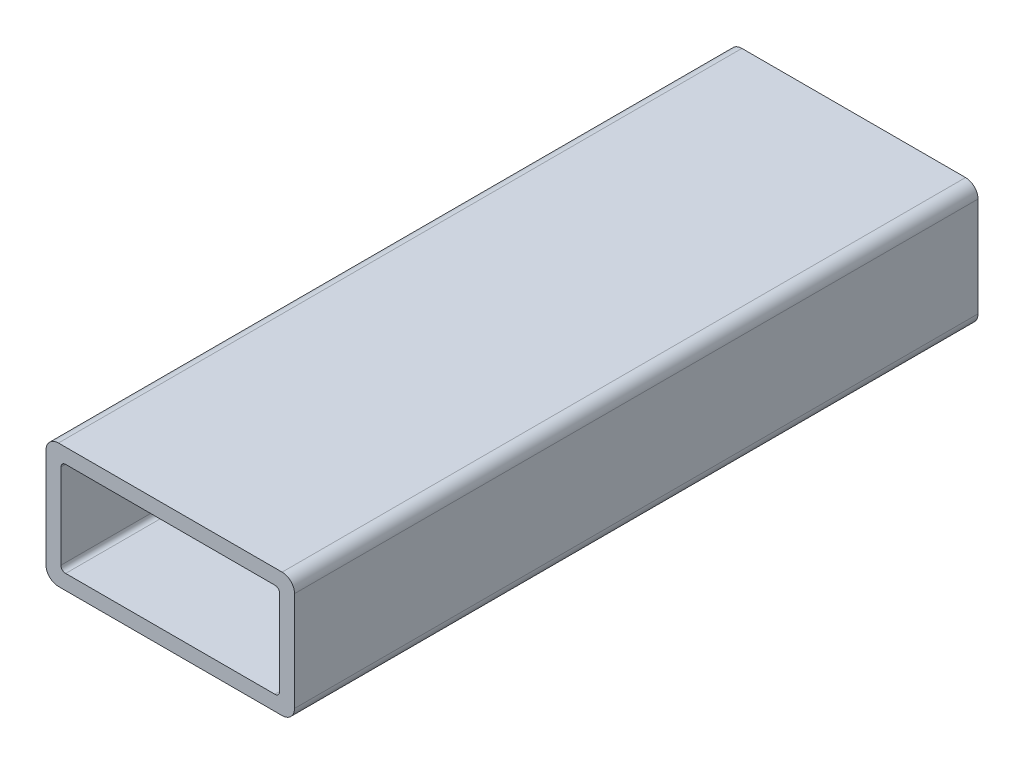
ISO-10303-21;
HEADER;
FILE_DESCRIPTION(('STEP AP214'),'2;1');
FILE_NAME('part.step','',(''),(''),'','','');
FILE_SCHEMA(('AUTOMOTIVE_DESIGN { 1 0 10303 214 1 1 1 1 }'));
ENDSEC;
DATA;
#1=APPLICATION_CONTEXT('core data for automotive mechanical design processes');
#2=APPLICATION_PROTOCOL_DEFINITION('international standard','automotive_design',2000,#1);
#3=PRODUCT_CONTEXT('',#1,'mechanical');
#4=PRODUCT('Part','Part','',(#3));
#5=PRODUCT_RELATED_PRODUCT_CATEGORY('part','',(#4));
#6=PRODUCT_DEFINITION_FORMATION('','',#4);
#7=PRODUCT_DEFINITION_CONTEXT('part definition',#1,'design');
#8=PRODUCT_DEFINITION('design','',#6,#7);
#9=PRODUCT_DEFINITION_SHAPE('','',#8);
#10=(LENGTH_UNIT() NAMED_UNIT(*) SI_UNIT(.MILLI.,.METRE.));
#11=(NAMED_UNIT(*) PLANE_ANGLE_UNIT() SI_UNIT($,.RADIAN.));
#12=(NAMED_UNIT(*) SI_UNIT($,.STERADIAN.) SOLID_ANGLE_UNIT());
#13=UNCERTAINTY_MEASURE_WITH_UNIT(LENGTH_MEASURE(1.E-05),#10,'distance_accuracy_value','');
#14=(GEOMETRIC_REPRESENTATION_CONTEXT(3) GLOBAL_UNCERTAINTY_ASSIGNED_CONTEXT((#13)) GLOBAL_UNIT_ASSIGNED_CONTEXT((#10,
#11,#12)) REPRESENTATION_CONTEXT('',''));
#15=CARTESIAN_POINT('',(0.,0.,0.));
#16=DIRECTION('',(0.,0.,1.));
#17=DIRECTION('',(1.,0.,0.));
#18=AXIS2_PLACEMENT_3D('',#15,#16,#17);
#19=CARTESIAN_POINT('',(22.86,-10.16,139.7));
#20=DIRECTION('',(0.,0.,1.));
#21=DIRECTION('',(1.,0.,0.));
#22=AXIS2_PLACEMENT_3D('',#19,#20,#21);
#23=PLANE('',#22);
#24=CARTESIAN_POINT('',(22.86,-10.16,139.7));
#25=DIRECTION('',(0.,0.,1.));
#26=DIRECTION('',(1.,0.,0.));
#27=AXIS2_PLACEMENT_3D('',#24,#25,#26);
#28=CIRCLE('',#27,2.54);
#29=CARTESIAN_POINT('',(22.86,-12.7,139.7));
#30=VERTEX_POINT('',#29);
#31=CARTESIAN_POINT('',(25.4,-10.16,139.7));
#32=VERTEX_POINT('',#31);
#33=EDGE_CURVE('E244',#30,#32,#28,.T.);
#34=ORIENTED_EDGE('',*,*,#33,.T.);
#35=DIRECTION('',(0.,1.,0.));
#36=VECTOR('',#35,1.);
#37=CARTESIAN_POINT('',(25.4,-10.16,139.7));
#38=LINE('',#37,#36);
#39=CARTESIAN_POINT('',(25.4,10.16,139.7));
#40=VERTEX_POINT('',#39);
#41=EDGE_CURVE('E248',#32,#40,#38,.T.);
#42=ORIENTED_EDGE('',*,*,#41,.T.);
#43=CARTESIAN_POINT('',(22.86,10.16,139.7));
#44=DIRECTION('',(0.,0.,1.));
#45=DIRECTION('',(1.,0.,0.));
#46=AXIS2_PLACEMENT_3D('',#43,#44,#45);
#47=CIRCLE('',#46,2.54);
#48=CARTESIAN_POINT('',(22.86,12.7,139.7));
#49=VERTEX_POINT('',#48);
#50=EDGE_CURVE('E252',#40,#49,#47,.T.);
#51=ORIENTED_EDGE('',*,*,#50,.T.);
#52=DIRECTION('',(-1.,0.,0.));
#53=VECTOR('',#52,1.);
#54=CARTESIAN_POINT('',(22.86,12.7,139.7));
#55=LINE('',#54,#53);
#56=CARTESIAN_POINT('',(-22.86,12.7,139.7));
#57=VERTEX_POINT('',#56);
#58=EDGE_CURVE('E255',#49,#57,#55,.T.);
#59=ORIENTED_EDGE('',*,*,#58,.T.);
#60=CARTESIAN_POINT('',(-22.86,10.16,139.7));
#61=DIRECTION('',(0.,0.,1.));
#62=DIRECTION('',(1.,0.,0.));
#63=AXIS2_PLACEMENT_3D('',#60,#61,#62);
#64=CIRCLE('',#63,2.54);
#65=CARTESIAN_POINT('',(-25.4,10.16,139.7));
#66=VERTEX_POINT('',#65);
#67=EDGE_CURVE('E258',#57,#66,#64,.T.);
#68=ORIENTED_EDGE('',*,*,#67,.T.);
#69=DIRECTION('',(0.,-1.,0.));
#70=VECTOR('',#69,1.);
#71=CARTESIAN_POINT('',(-25.4,-10.16,139.7));
#72=LINE('',#71,#70);
#73=CARTESIAN_POINT('',(-25.4,-10.16,139.7));
#74=VERTEX_POINT('',#73);
#75=EDGE_CURVE('E261',#66,#74,#72,.T.);
#76=ORIENTED_EDGE('',*,*,#75,.T.);
#77=CARTESIAN_POINT('',(-22.86,-10.16,139.7));
#78=DIRECTION('',(0.,0.,1.));
#79=DIRECTION('',(1.,0.,0.));
#80=AXIS2_PLACEMENT_3D('',#77,#78,#79);
#81=CIRCLE('',#80,2.54);
#82=CARTESIAN_POINT('',(-22.86,-12.7,139.7));
#83=VERTEX_POINT('',#82);
#84=EDGE_CURVE('E264',#74,#83,#81,.T.);
#85=ORIENTED_EDGE('',*,*,#84,.T.);
#86=DIRECTION('',(1.,0.,0.));
#87=VECTOR('',#86,1.);
#88=CARTESIAN_POINT('',(22.86,-12.7,139.7));
#89=LINE('',#88,#87);
#90=EDGE_CURVE('E267',#83,#30,#89,.T.);
#91=ORIENTED_EDGE('',*,*,#90,.T.);
#92=EDGE_LOOP('',(#34,#42,#51,#59,#68,#76,#85,#91));
#93=FACE_BOUND('',#92,.T.);
#94=DIRECTION('',(-1.,0.,0.));
#95=VECTOR('',#94,1.);
#96=CARTESIAN_POINT('',(21.3868,9.65199999999999,139.7));
#97=LINE('',#96,#95);
#98=CARTESIAN_POINT('',(21.3868,9.65199999999999,139.7));
#99=VERTEX_POINT('',#98);
#100=CARTESIAN_POINT('',(-21.3868,9.652,139.7));
#101=VERTEX_POINT('',#100);
#102=EDGE_CURVE('E164',#99,#101,#97,.T.);
#103=ORIENTED_EDGE('',*,*,#102,.F.);
#104=CARTESIAN_POINT('',(21.3868,8.6868,139.7));
#105=DIRECTION('',(0.,0.,1.));
#106=DIRECTION('',(1.,0.,0.));
#107=AXIS2_PLACEMENT_3D('',#104,#105,#106);
#108=CIRCLE('',#107,0.965199999999993);
#109=CARTESIAN_POINT('',(22.352,8.68680000000001,139.7));
#110=VERTEX_POINT('',#109);
#111=EDGE_CURVE('E155',#110,#99,#108,.T.);
#112=ORIENTED_EDGE('',*,*,#111,.F.);
#113=DIRECTION('',(0.,1.,0.));
#114=VECTOR('',#113,1.);
#115=CARTESIAN_POINT('',(22.352,8.68680000000001,139.7));
#116=LINE('',#115,#114);
#117=CARTESIAN_POINT('',(22.352,-8.6868,139.7));
#118=VERTEX_POINT('',#117);
#119=EDGE_CURVE('E196',#118,#110,#116,.T.);
#120=ORIENTED_EDGE('',*,*,#119,.F.);
#121=CARTESIAN_POINT('',(21.3868,-8.6868,139.7));
#122=DIRECTION('',(0.,0.,1.));
#123=DIRECTION('',(1.,0.,0.));
#124=AXIS2_PLACEMENT_3D('',#121,#122,#123);
#125=CIRCLE('',#124,0.965199999999999);
#126=CARTESIAN_POINT('',(21.3868,-9.652,139.7));
#127=VERTEX_POINT('',#126);
#128=EDGE_CURVE('E193',#127,#118,#125,.T.);
#129=ORIENTED_EDGE('',*,*,#128,.F.);
#130=DIRECTION('',(1.,0.,0.));
#131=VECTOR('',#130,1.);
#132=CARTESIAN_POINT('',(21.3868,-9.652,139.7));
#133=LINE('',#132,#131);
#134=CARTESIAN_POINT('',(-21.3868,-9.652,139.7));
#135=VERTEX_POINT('',#134);
#136=EDGE_CURVE('E190',#135,#127,#133,.T.);
#137=ORIENTED_EDGE('',*,*,#136,.F.);
#138=CARTESIAN_POINT('',(-21.3868,-8.6868,139.7));
#139=DIRECTION('',(0.,0.,1.));
#140=DIRECTION('',(1.,0.,0.));
#141=AXIS2_PLACEMENT_3D('',#138,#139,#140);
#142=CIRCLE('',#141,0.965199999999999);
#143=CARTESIAN_POINT('',(-22.352,-8.6868,139.7));
#144=VERTEX_POINT('',#143);
#145=EDGE_CURVE('E187',#144,#135,#142,.T.);
#146=ORIENTED_EDGE('',*,*,#145,.F.);
#147=DIRECTION('',(0.,-1.,0.));
#148=VECTOR('',#147,1.);
#149=CARTESIAN_POINT('',(-22.352,8.6868,139.7));
#150=LINE('',#149,#148);
#151=CARTESIAN_POINT('',(-22.352,8.6868,139.7));
#152=VERTEX_POINT('',#151);
#153=EDGE_CURVE('E182',#152,#144,#150,.T.);
#154=ORIENTED_EDGE('',*,*,#153,.F.);
#155=CARTESIAN_POINT('',(-21.3868,8.6868,139.7));
#156=DIRECTION('',(0.,0.,1.));
#157=DIRECTION('',(1.,0.,0.));
#158=AXIS2_PLACEMENT_3D('',#155,#156,#157);
#159=CIRCLE('',#158,0.965199999999999);
#160=EDGE_CURVE('E178',#101,#152,#159,.T.);
#161=ORIENTED_EDGE('',*,*,#160,.F.);
#162=EDGE_LOOP('',(#103,#112,#120,#129,#137,#146,#154,#161));
#163=FACE_BOUND('',#162,.T.);
#164=ADVANCED_FACE('F41',(#93,#163),#23,.T.);
#165=CARTESIAN_POINT('',(22.86,-10.16,0.));
#166=DIRECTION('',(0.,0.,1.));
#167=DIRECTION('',(1.,0.,0.));
#168=AXIS2_PLACEMENT_3D('',#165,#166,#167);
#169=PLANE('',#168);
#170=CARTESIAN_POINT('',(22.86,-10.16,0.));
#171=DIRECTION('',(0.,0.,1.));
#172=DIRECTION('',(1.,0.,0.));
#173=AXIS2_PLACEMENT_3D('',#170,#171,#172);
#174=CIRCLE('',#173,2.54);
#175=CARTESIAN_POINT('',(22.86,-12.7,0.));
#176=VERTEX_POINT('',#175);
#177=CARTESIAN_POINT('',(25.4,-10.16,0.));
#178=VERTEX_POINT('',#177);
#179=EDGE_CURVE('E173',#176,#178,#174,.T.);
#180=ORIENTED_EDGE('',*,*,#179,.F.);
#181=DIRECTION('',(1.,0.,0.));
#182=VECTOR('',#181,1.);
#183=CARTESIAN_POINT('',(22.86,-12.7,0.));
#184=LINE('',#183,#182);
#185=CARTESIAN_POINT('',(-22.86,-12.7,0.));
#186=VERTEX_POINT('',#185);
#187=EDGE_CURVE('E249',#186,#176,#184,.T.);
#188=ORIENTED_EDGE('',*,*,#187,.F.);
#189=CARTESIAN_POINT('',(-22.86,-10.16,0.));
#190=DIRECTION('',(0.,0.,1.));
#191=DIRECTION('',(1.,0.,0.));
#192=AXIS2_PLACEMENT_3D('',#189,#190,#191);
#193=CIRCLE('',#192,2.54);
#194=CARTESIAN_POINT('',(-25.4,-10.16,0.));
#195=VERTEX_POINT('',#194);
#196=EDGE_CURVE('E289',#195,#186,#193,.T.);
#197=ORIENTED_EDGE('',*,*,#196,.F.);
#198=DIRECTION('',(0.,-1.,0.));
#199=VECTOR('',#198,1.);
#200=CARTESIAN_POINT('',(-25.4,-10.16,0.));
#201=LINE('',#200,#199);
#202=CARTESIAN_POINT('',(-25.4,10.16,0.));
#203=VERTEX_POINT('',#202);
#204=EDGE_CURVE('E286',#203,#195,#201,.T.);
#205=ORIENTED_EDGE('',*,*,#204,.F.);
#206=CARTESIAN_POINT('',(-22.86,10.16,0.));
#207=DIRECTION('',(0.,0.,1.));
#208=DIRECTION('',(1.,0.,0.));
#209=AXIS2_PLACEMENT_3D('',#206,#207,#208);
#210=CIRCLE('',#209,2.54);
#211=CARTESIAN_POINT('',(-22.86,12.7,0.));
#212=VERTEX_POINT('',#211);
#213=EDGE_CURVE('E283',#212,#203,#210,.T.);
#214=ORIENTED_EDGE('',*,*,#213,.F.);
#215=DIRECTION('',(-1.,0.,0.));
#216=VECTOR('',#215,1.);
#217=CARTESIAN_POINT('',(22.86,12.7,0.));
#218=LINE('',#217,#216);
#219=CARTESIAN_POINT('',(22.86,12.7,0.));
#220=VERTEX_POINT('',#219);
#221=EDGE_CURVE('E280',#220,#212,#218,.T.);
#222=ORIENTED_EDGE('',*,*,#221,.F.);
#223=CARTESIAN_POINT('',(22.86,10.16,0.));
#224=DIRECTION('',(0.,0.,1.));
#225=DIRECTION('',(1.,0.,0.));
#226=AXIS2_PLACEMENT_3D('',#223,#224,#225);
#227=CIRCLE('',#226,2.54);
#228=CARTESIAN_POINT('',(25.4,10.16,0.));
#229=VERTEX_POINT('',#228);
#230=EDGE_CURVE('E277',#229,#220,#227,.T.);
#231=ORIENTED_EDGE('',*,*,#230,.F.);
#232=DIRECTION('',(0.,1.,0.));
#233=VECTOR('',#232,1.);
#234=CARTESIAN_POINT('',(25.4,-10.16,0.));
#235=LINE('',#234,#233);
#236=EDGE_CURVE('E274',#178,#229,#235,.T.);
#237=ORIENTED_EDGE('',*,*,#236,.F.);
#238=EDGE_LOOP('',(#180,#188,#197,#205,#214,#222,#231,#237));
#239=FACE_BOUND('',#238,.T.);
#240=CARTESIAN_POINT('',(21.3868,8.6868,0.));
#241=DIRECTION('',(0.,0.,1.));
#242=DIRECTION('',(1.,0.,0.));
#243=AXIS2_PLACEMENT_3D('',#240,#241,#242);
#244=CIRCLE('',#243,0.965199999999993);
#245=CARTESIAN_POINT('',(22.352,8.68680000000001,0.));
#246=VERTEX_POINT('',#245);
#247=CARTESIAN_POINT('',(21.3868,9.65199999999999,0.));
#248=VERTEX_POINT('',#247);
#249=EDGE_CURVE('E65',#246,#248,#244,.T.);
#250=ORIENTED_EDGE('',*,*,#249,.T.);
#251=DIRECTION('',(-1.,0.,0.));
#252=VECTOR('',#251,1.);
#253=CARTESIAN_POINT('',(21.3868,9.65199999999999,0.));
#254=LINE('',#253,#252);
#255=CARTESIAN_POINT('',(-21.3868,9.652,0.));
#256=VERTEX_POINT('',#255);
#257=EDGE_CURVE('E171',#248,#256,#254,.T.);
#258=ORIENTED_EDGE('',*,*,#257,.T.);
#259=CARTESIAN_POINT('',(-21.3868,8.6868,0.));
#260=DIRECTION('',(0.,0.,1.));
#261=DIRECTION('',(1.,0.,0.));
#262=AXIS2_PLACEMENT_3D('',#259,#260,#261);
#263=CIRCLE('',#262,0.965199999999999);
#264=CARTESIAN_POINT('',(-22.352,8.6868,0.));
#265=VERTEX_POINT('',#264);
#266=EDGE_CURVE('E203',#256,#265,#263,.T.);
#267=ORIENTED_EDGE('',*,*,#266,.T.);
#268=DIRECTION('',(0.,-1.,0.));
#269=VECTOR('',#268,1.);
#270=CARTESIAN_POINT('',(-22.352,8.6868,0.));
#271=LINE('',#270,#269);
#272=CARTESIAN_POINT('',(-22.352,-8.6868,0.));
#273=VERTEX_POINT('',#272);
#274=EDGE_CURVE('E207',#265,#273,#271,.T.);
#275=ORIENTED_EDGE('',*,*,#274,.T.);
#276=CARTESIAN_POINT('',(-21.3868,-8.6868,0.));
#277=DIRECTION('',(0.,0.,1.));
#278=DIRECTION('',(1.,0.,0.));
#279=AXIS2_PLACEMENT_3D('',#276,#277,#278);
#280=CIRCLE('',#279,0.965199999999999);
#281=CARTESIAN_POINT('',(-21.3868,-9.652,0.));
#282=VERTEX_POINT('',#281);
#283=EDGE_CURVE('E211',#273,#282,#280,.T.);
#284=ORIENTED_EDGE('',*,*,#283,.T.);
#285=DIRECTION('',(1.,0.,0.));
#286=VECTOR('',#285,1.);
#287=CARTESIAN_POINT('',(21.3868,-9.652,0.));
#288=LINE('',#287,#286);
#289=CARTESIAN_POINT('',(21.3868,-9.652,0.));
#290=VERTEX_POINT('',#289);
#291=EDGE_CURVE('E215',#282,#290,#288,.T.);
#292=ORIENTED_EDGE('',*,*,#291,.T.);
#293=CARTESIAN_POINT('',(21.3868,-8.6868,0.));
#294=DIRECTION('',(0.,0.,1.));
#295=DIRECTION('',(1.,0.,0.));
#296=AXIS2_PLACEMENT_3D('',#293,#294,#295);
#297=CIRCLE('',#296,0.965199999999999);
#298=CARTESIAN_POINT('',(22.352,-8.6868,0.));
#299=VERTEX_POINT('',#298);
#300=EDGE_CURVE('E219',#290,#299,#297,.T.);
#301=ORIENTED_EDGE('',*,*,#300,.T.);
#302=DIRECTION('',(0.,1.,0.));
#303=VECTOR('',#302,1.);
#304=CARTESIAN_POINT('',(22.352,8.68680000000001,0.));
#305=LINE('',#304,#303);
#306=EDGE_CURVE('E165',#299,#246,#305,.T.);
#307=ORIENTED_EDGE('',*,*,#306,.T.);
#308=EDGE_LOOP('',(#250,#258,#267,#275,#284,#292,#301,#307));
#309=FACE_BOUND('',#308,.T.);
#310=ADVANCED_FACE('F328',(#239,#309),#169,.F.);
#311=CARTESIAN_POINT('',(22.86,-10.16,139.7));
#312=DIRECTION('',(0.,0.,-1.));
#313=DIRECTION('',(-1.,0.,0.));
#314=AXIS2_PLACEMENT_3D('',#311,#312,#313);
#315=CYLINDRICAL_SURFACE('',#314,2.54);
#316=ORIENTED_EDGE('',*,*,#179,.T.);
#317=DIRECTION('',(0.,0.,-1.));
#318=VECTOR('',#317,1.);
#319=CARTESIAN_POINT('',(25.4,-10.16,139.7));
#320=LINE('',#319,#318);
#321=EDGE_CURVE('E11',#32,#178,#320,.T.);
#322=ORIENTED_EDGE('',*,*,#321,.F.);
#323=ORIENTED_EDGE('',*,*,#33,.F.);
#324=DIRECTION('',(0.,0.,-1.));
#325=VECTOR('',#324,1.);
#326=CARTESIAN_POINT('',(22.86,-12.7,139.7));
#327=LINE('',#326,#325);
#328=EDGE_CURVE('E270',#30,#176,#327,.T.);
#329=ORIENTED_EDGE('',*,*,#328,.T.);
#330=EDGE_LOOP('',(#316,#322,#323,#329));
#331=FACE_BOUND('',#330,.T.);
#332=ADVANCED_FACE('F43',(#331),#315,.T.);
#333=CARTESIAN_POINT('',(25.4,-10.16,139.7));
#334=DIRECTION('',(-1.,0.,0.));
#335=DIRECTION('',(0.,0.,1.));
#336=AXIS2_PLACEMENT_3D('',#333,#334,#335);
#337=PLANE('',#336);
#338=ORIENTED_EDGE('',*,*,#236,.T.);
#339=DIRECTION('',(0.,0.,-1.));
#340=VECTOR('',#339,1.);
#341=CARTESIAN_POINT('',(25.4,10.16,139.7));
#342=LINE('',#341,#340);
#343=EDGE_CURVE('E50',#40,#229,#342,.T.);
#344=ORIENTED_EDGE('',*,*,#343,.F.);
#345=ORIENTED_EDGE('',*,*,#41,.F.);
#346=ORIENTED_EDGE('',*,*,#321,.T.);
#347=EDGE_LOOP('',(#338,#344,#345,#346));
#348=FACE_BOUND('',#347,.T.);
#349=ADVANCED_FACE('F345',(#348),#337,.F.);
#350=CARTESIAN_POINT('',(22.86,10.16,139.7));
#351=DIRECTION('',(0.,0.,-1.));
#352=DIRECTION('',(-1.,0.,0.));
#353=AXIS2_PLACEMENT_3D('',#350,#351,#352);
#354=CYLINDRICAL_SURFACE('',#353,2.54);
#355=ORIENTED_EDGE('',*,*,#230,.T.);
#356=DIRECTION('',(0.,0.,-1.));
#357=VECTOR('',#356,1.);
#358=CARTESIAN_POINT('',(22.86,12.7,139.7));
#359=LINE('',#358,#357);
#360=EDGE_CURVE('E313',#49,#220,#359,.T.);
#361=ORIENTED_EDGE('',*,*,#360,.F.);
#362=ORIENTED_EDGE('',*,*,#50,.F.);
#363=ORIENTED_EDGE('',*,*,#343,.T.);
#364=EDGE_LOOP('',(#355,#361,#362,#363));
#365=FACE_BOUND('',#364,.T.);
#366=ADVANCED_FACE('F322',(#365),#354,.T.);
#367=CARTESIAN_POINT('',(22.86,12.7,139.7));
#368=DIRECTION('',(0.,-1.,0.));
#369=DIRECTION('',(0.,0.,-1.));
#370=AXIS2_PLACEMENT_3D('',#367,#368,#369);
#371=PLANE('',#370);
#372=ORIENTED_EDGE('',*,*,#221,.T.);
#373=DIRECTION('',(0.,0.,-1.));
#374=VECTOR('',#373,1.);
#375=CARTESIAN_POINT('',(-22.86,12.7,139.7));
#376=LINE('',#375,#374);
#377=EDGE_CURVE('E309',#57,#212,#376,.T.);
#378=ORIENTED_EDGE('',*,*,#377,.F.);
#379=ORIENTED_EDGE('',*,*,#58,.F.);
#380=ORIENTED_EDGE('',*,*,#360,.T.);
#381=EDGE_LOOP('',(#372,#378,#379,#380));
#382=FACE_BOUND('',#381,.T.);
#383=ADVANCED_FACE('F334',(#382),#371,.F.);
#384=CARTESIAN_POINT('',(-22.86,10.16,139.7));
#385=DIRECTION('',(0.,0.,-1.));
#386=DIRECTION('',(-1.,0.,0.));
#387=AXIS2_PLACEMENT_3D('',#384,#385,#386);
#388=CYLINDRICAL_SURFACE('',#387,2.54);
#389=ORIENTED_EDGE('',*,*,#213,.T.);
#390=DIRECTION('',(0.,0.,-1.));
#391=VECTOR('',#390,1.);
#392=CARTESIAN_POINT('',(-25.4,10.16,139.7));
#393=LINE('',#392,#391);
#394=EDGE_CURVE('E305',#66,#203,#393,.T.);
#395=ORIENTED_EDGE('',*,*,#394,.F.);
#396=ORIENTED_EDGE('',*,*,#67,.F.);
#397=ORIENTED_EDGE('',*,*,#377,.T.);
#398=EDGE_LOOP('',(#389,#395,#396,#397));
#399=FACE_BOUND('',#398,.T.);
#400=ADVANCED_FACE('F338',(#399),#388,.T.);
#401=CARTESIAN_POINT('',(-25.4,-10.16,139.7));
#402=DIRECTION('',(1.,0.,0.));
#403=DIRECTION('',(0.,0.,-1.));
#404=AXIS2_PLACEMENT_3D('',#401,#402,#403);
#405=PLANE('',#404);
#406=ORIENTED_EDGE('',*,*,#204,.T.);
#407=DIRECTION('',(0.,0.,-1.));
#408=VECTOR('',#407,1.);
#409=CARTESIAN_POINT('',(-25.4,-10.16,139.7));
#410=LINE('',#409,#408);
#411=EDGE_CURVE('E301',#74,#195,#410,.T.);
#412=ORIENTED_EDGE('',*,*,#411,.F.);
#413=ORIENTED_EDGE('',*,*,#75,.F.);
#414=ORIENTED_EDGE('',*,*,#394,.T.);
#415=EDGE_LOOP('',(#406,#412,#413,#414));
#416=FACE_BOUND('',#415,.T.);
#417=ADVANCED_FACE('F358',(#416),#405,.F.);
#418=CARTESIAN_POINT('',(-22.86,-10.16,139.7));
#419=DIRECTION('',(0.,0.,-1.));
#420=DIRECTION('',(-1.,0.,0.));
#421=AXIS2_PLACEMENT_3D('',#418,#419,#420);
#422=CYLINDRICAL_SURFACE('',#421,2.54);
#423=ORIENTED_EDGE('',*,*,#196,.T.);
#424=DIRECTION('',(0.,0.,-1.));
#425=VECTOR('',#424,1.);
#426=CARTESIAN_POINT('',(-22.86,-12.7,139.7));
#427=LINE('',#426,#425);
#428=EDGE_CURVE('E297',#83,#186,#427,.T.);
#429=ORIENTED_EDGE('',*,*,#428,.F.);
#430=ORIENTED_EDGE('',*,*,#84,.F.);
#431=ORIENTED_EDGE('',*,*,#411,.T.);
#432=EDGE_LOOP('',(#423,#429,#430,#431));
#433=FACE_BOUND('',#432,.T.);
#434=ADVANCED_FACE('F356',(#433),#422,.T.);
#435=CARTESIAN_POINT('',(22.86,-12.7,139.7));
#436=DIRECTION('',(0.,1.,0.));
#437=DIRECTION('',(0.,0.,1.));
#438=AXIS2_PLACEMENT_3D('',#435,#436,#437);
#439=PLANE('',#438);
#440=ORIENTED_EDGE('',*,*,#187,.T.);
#441=ORIENTED_EDGE('',*,*,#328,.F.);
#442=ORIENTED_EDGE('',*,*,#90,.F.);
#443=ORIENTED_EDGE('',*,*,#428,.T.);
#444=EDGE_LOOP('',(#440,#441,#442,#443));
#445=FACE_BOUND('',#444,.T.);
#446=ADVANCED_FACE('F351',(#445),#439,.F.);
#447=CARTESIAN_POINT('',(21.3868,8.6868,139.7));
#448=DIRECTION('',(0.,0.,-1.));
#449=DIRECTION('',(-1.,0.,0.));
#450=AXIS2_PLACEMENT_3D('',#447,#448,#449);
#451=CYLINDRICAL_SURFACE('',#450,0.965199999999993);
#452=ORIENTED_EDGE('',*,*,#249,.F.);
#453=DIRECTION('',(0.,0.,-1.));
#454=VECTOR('',#453,1.);
#455=CARTESIAN_POINT('',(22.352,8.68680000000001,139.7));
#456=LINE('',#455,#454);
#457=EDGE_CURVE('E159',#110,#246,#456,.T.);
#458=ORIENTED_EDGE('',*,*,#457,.F.);
#459=ORIENTED_EDGE('',*,*,#111,.T.);
#460=DIRECTION('',(0.,0.,-1.));
#461=VECTOR('',#460,1.);
#462=CARTESIAN_POINT('',(21.3868,9.65199999999999,139.7));
#463=LINE('',#462,#461);
#464=EDGE_CURVE('E158',#99,#248,#463,.T.);
#465=ORIENTED_EDGE('',*,*,#464,.T.);
#466=EDGE_LOOP('',(#452,#458,#459,#465));
#467=FACE_BOUND('',#466,.T.);
#468=ADVANCED_FACE('F157',(#467),#451,.F.);
#469=CARTESIAN_POINT('',(21.3868,9.65199999999999,139.7));
#470=DIRECTION('',(0.,-1.,0.));
#471=DIRECTION('',(1.,0.,0.));
#472=AXIS2_PLACEMENT_3D('',#469,#470,#471);
#473=PLANE('',#472);
#474=ORIENTED_EDGE('',*,*,#257,.F.);
#475=ORIENTED_EDGE('',*,*,#464,.F.);
#476=ORIENTED_EDGE('',*,*,#102,.T.);
#477=DIRECTION('',(0.,0.,-1.));
#478=VECTOR('',#477,1.);
#479=CARTESIAN_POINT('',(-21.3868,9.652,139.7));
#480=LINE('',#479,#478);
#481=EDGE_CURVE('E174',#101,#256,#480,.T.);
#482=ORIENTED_EDGE('',*,*,#481,.T.);
#483=EDGE_LOOP('',(#474,#475,#476,#482));
#484=FACE_BOUND('',#483,.T.);
#485=ADVANCED_FACE('F168',(#484),#473,.T.);
#486=CARTESIAN_POINT('',(-21.3868,8.6868,139.7));
#487=DIRECTION('',(0.,0.,-1.));
#488=DIRECTION('',(-1.,0.,0.));
#489=AXIS2_PLACEMENT_3D('',#486,#487,#488);
#490=CYLINDRICAL_SURFACE('',#489,0.965199999999999);
#491=ORIENTED_EDGE('',*,*,#266,.F.);
#492=ORIENTED_EDGE('',*,*,#481,.F.);
#493=ORIENTED_EDGE('',*,*,#160,.T.);
#494=DIRECTION('',(0.,0.,-1.));
#495=VECTOR('',#494,1.);
#496=CARTESIAN_POINT('',(-22.352,8.6868,139.7));
#497=LINE('',#496,#495);
#498=EDGE_CURVE('E239',#152,#265,#497,.T.);
#499=ORIENTED_EDGE('',*,*,#498,.T.);
#500=EDGE_LOOP('',(#491,#492,#493,#499));
#501=FACE_BOUND('',#500,.T.);
#502=ADVANCED_FACE('F383',(#501),#490,.F.);
#503=CARTESIAN_POINT('',(-22.352,8.6868,139.7));
#504=DIRECTION('',(1.,0.,0.));
#505=DIRECTION('',(0.,0.,-1.));
#506=AXIS2_PLACEMENT_3D('',#503,#504,#505);
#507=PLANE('',#506);
#508=ORIENTED_EDGE('',*,*,#274,.F.);
#509=ORIENTED_EDGE('',*,*,#498,.F.);
#510=ORIENTED_EDGE('',*,*,#153,.T.);
#511=DIRECTION('',(0.,0.,-1.));
#512=VECTOR('',#511,1.);
#513=CARTESIAN_POINT('',(-22.352,-8.6868,139.7));
#514=LINE('',#513,#512);
#515=EDGE_CURVE('E236',#144,#273,#514,.T.);
#516=ORIENTED_EDGE('',*,*,#515,.T.);
#517=EDGE_LOOP('',(#508,#509,#510,#516));
#518=FACE_BOUND('',#517,.T.);
#519=ADVANCED_FACE('F387',(#518),#507,.T.);
#520=CARTESIAN_POINT('',(-21.3868,-8.6868,139.7));
#521=DIRECTION('',(0.,0.,-1.));
#522=DIRECTION('',(-1.,0.,0.));
#523=AXIS2_PLACEMENT_3D('',#520,#521,#522);
#524=CYLINDRICAL_SURFACE('',#523,0.965199999999999);
#525=ORIENTED_EDGE('',*,*,#283,.F.);
#526=ORIENTED_EDGE('',*,*,#515,.F.);
#527=ORIENTED_EDGE('',*,*,#145,.T.);
#528=DIRECTION('',(0.,0.,-1.));
#529=VECTOR('',#528,1.);
#530=CARTESIAN_POINT('',(-21.3868,-9.652,139.7));
#531=LINE('',#530,#529);
#532=EDGE_CURVE('E233',#135,#282,#531,.T.);
#533=ORIENTED_EDGE('',*,*,#532,.T.);
#534=EDGE_LOOP('',(#525,#526,#527,#533));
#535=FACE_BOUND('',#534,.T.);
#536=ADVANCED_FACE('F393',(#535),#524,.F.);
#537=CARTESIAN_POINT('',(21.3868,-9.652,139.7));
#538=DIRECTION('',(0.,1.,0.));
#539=DIRECTION('',(-1.,0.,0.));
#540=AXIS2_PLACEMENT_3D('',#537,#538,#539);
#541=PLANE('',#540);
#542=ORIENTED_EDGE('',*,*,#291,.F.);
#543=ORIENTED_EDGE('',*,*,#532,.F.);
#544=ORIENTED_EDGE('',*,*,#136,.T.);
#545=DIRECTION('',(0.,0.,-1.));
#546=VECTOR('',#545,1.);
#547=CARTESIAN_POINT('',(21.3868,-9.652,139.7));
#548=LINE('',#547,#546);
#549=EDGE_CURVE('E230',#127,#290,#548,.T.);
#550=ORIENTED_EDGE('',*,*,#549,.T.);
#551=EDGE_LOOP('',(#542,#543,#544,#550));
#552=FACE_BOUND('',#551,.T.);
#553=ADVANCED_FACE('F397',(#552),#541,.T.);
#554=CARTESIAN_POINT('',(21.3868,-8.6868,139.7));
#555=DIRECTION('',(0.,0.,-1.));
#556=DIRECTION('',(-1.,0.,0.));
#557=AXIS2_PLACEMENT_3D('',#554,#555,#556);
#558=CYLINDRICAL_SURFACE('',#557,0.965199999999999);
#559=ORIENTED_EDGE('',*,*,#300,.F.);
#560=ORIENTED_EDGE('',*,*,#549,.F.);
#561=ORIENTED_EDGE('',*,*,#128,.T.);
#562=DIRECTION('',(0.,0.,-1.));
#563=VECTOR('',#562,1.);
#564=CARTESIAN_POINT('',(22.352,-8.6868,139.7));
#565=LINE('',#564,#563);
#566=EDGE_CURVE('E57',#118,#299,#565,.T.);
#567=ORIENTED_EDGE('',*,*,#566,.T.);
#568=EDGE_LOOP('',(#559,#560,#561,#567));
#569=FACE_BOUND('',#568,.T.);
#570=ADVANCED_FACE('F401',(#569),#558,.F.);
#571=CARTESIAN_POINT('',(22.352,8.68680000000001,139.7));
#572=DIRECTION('',(-1.,0.,0.));
#573=DIRECTION('',(0.,-1.,0.));
#574=AXIS2_PLACEMENT_3D('',#571,#572,#573);
#575=PLANE('',#574);
#576=ORIENTED_EDGE('',*,*,#306,.F.);
#577=ORIENTED_EDGE('',*,*,#566,.F.);
#578=ORIENTED_EDGE('',*,*,#119,.T.);
#579=ORIENTED_EDGE('',*,*,#457,.T.);
#580=EDGE_LOOP('',(#576,#577,#578,#579));
#581=FACE_BOUND('',#580,.T.);
#582=ADVANCED_FACE('F405',(#581),#575,.T.);
#583=CLOSED_SHELL('',(#164,#310,#332,#349,#366,#383,#400,#417,#434,#446,#468,#485,#502,#519,
#536,#553,#570,#582));
#584=MANIFOLD_SOLID_BREP('B2',#583);
#585=ADVANCED_BREP_SHAPE_REPRESENTATION('',(#18,#584),#14);
#586=SHAPE_DEFINITION_REPRESENTATION(#9,#585);
ENDSEC;
END-ISO-10303-21;
